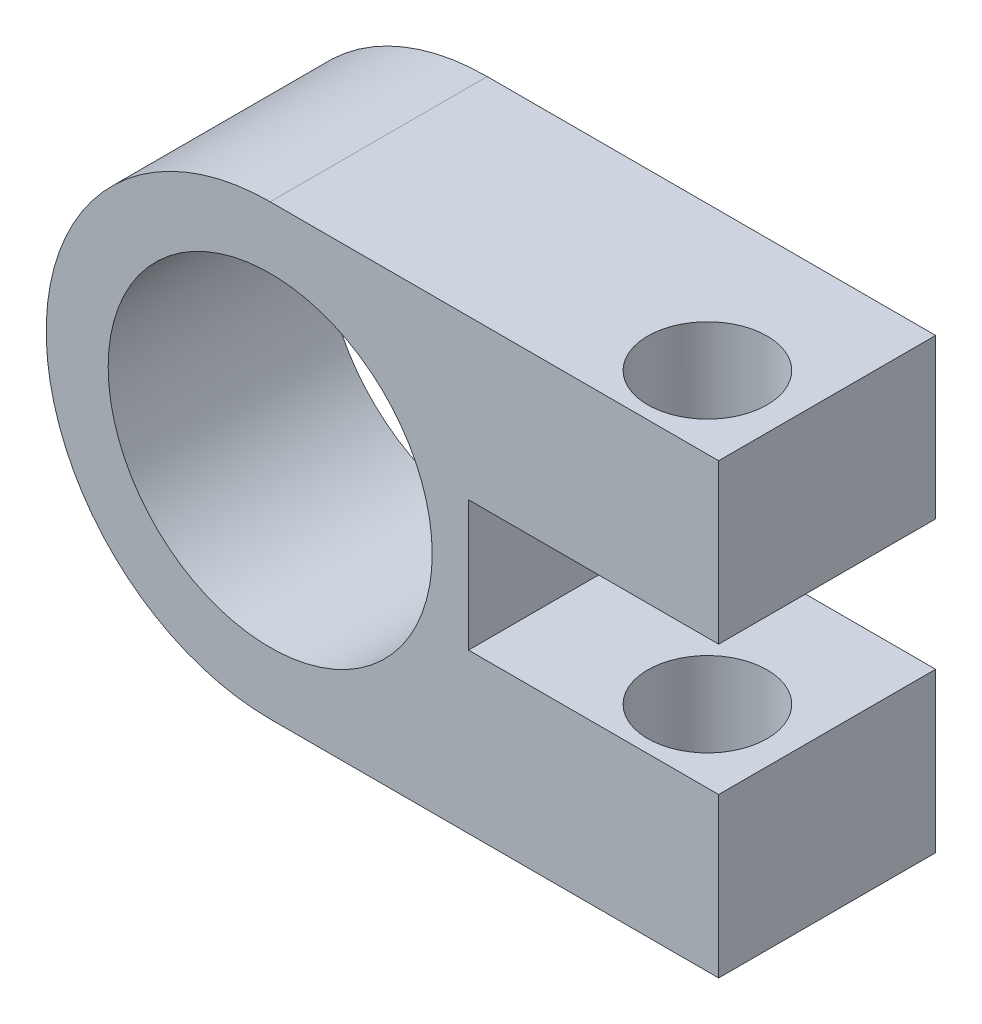
ISO-10303-21;
HEADER;
FILE_DESCRIPTION(('STEP AP214'),'2;1');
FILE_NAME('part.step','',(''),(''),'','','');
FILE_SCHEMA(('AUTOMOTIVE_DESIGN { 1 0 10303 214 1 1 1 1 }'));
ENDSEC;
DATA;
#1=APPLICATION_CONTEXT('core data for automotive mechanical design processes');
#2=APPLICATION_PROTOCOL_DEFINITION('international standard','automotive_design',2000,#1);
#3=PRODUCT_CONTEXT('',#1,'mechanical');
#4=PRODUCT('Part','Part','',(#3));
#5=PRODUCT_RELATED_PRODUCT_CATEGORY('part','',(#4));
#6=PRODUCT_DEFINITION_FORMATION('','',#4);
#7=PRODUCT_DEFINITION_CONTEXT('part definition',#1,'design');
#8=PRODUCT_DEFINITION('design','',#6,#7);
#9=PRODUCT_DEFINITION_SHAPE('','',#8);
#10=(LENGTH_UNIT() NAMED_UNIT(*) SI_UNIT(.MILLI.,.METRE.));
#11=(NAMED_UNIT(*) PLANE_ANGLE_UNIT() SI_UNIT($,.RADIAN.));
#12=(NAMED_UNIT(*) SI_UNIT($,.STERADIAN.) SOLID_ANGLE_UNIT());
#13=UNCERTAINTY_MEASURE_WITH_UNIT(LENGTH_MEASURE(1.E-05),#10,'distance_accuracy_value','');
#14=(GEOMETRIC_REPRESENTATION_CONTEXT(3) GLOBAL_UNCERTAINTY_ASSIGNED_CONTEXT((#13)) GLOBAL_UNIT_ASSIGNED_CONTEXT((#10,
#11,#12)) REPRESENTATION_CONTEXT('',''));
#15=CARTESIAN_POINT('',(0.,0.,0.));
#16=DIRECTION('',(0.,0.,1.));
#17=DIRECTION('',(1.,0.,0.));
#18=AXIS2_PLACEMENT_3D('',#15,#16,#17);
#19=CARTESIAN_POINT('',(31.,-15.4836362305049,15.));
#20=DIRECTION('',(-1.,0.,0.));
#21=DIRECTION('',(0.,0.,1.));
#22=AXIS2_PLACEMENT_3D('',#19,#20,#21);
#23=PLANE('',#22);
#24=DIRECTION('',(0.,0.,1.));
#25=VECTOR('',#24,1.);
#26=CARTESIAN_POINT('',(31.,4.5,-23.));
#27=LINE('',#26,#25);
#28=CARTESIAN_POINT('',(31.,4.5,0.));
#29=VERTEX_POINT('',#28);
#30=CARTESIAN_POINT('',(31.,4.5,15.));
#31=VERTEX_POINT('',#30);
#32=EDGE_CURVE('E186',#29,#31,#27,.T.);
#33=ORIENTED_EDGE('',*,*,#32,.F.);
#34=DIRECTION('',(0.,1.,0.));
#35=VECTOR('',#34,1.);
#36=CARTESIAN_POINT('',(31.,-15.4836362305049,0.));
#37=LINE('',#36,#35);
#38=CARTESIAN_POINT('',(31.,15.4836362305049,0.));
#39=VERTEX_POINT('',#38);
#40=EDGE_CURVE('E145',#29,#39,#37,.T.);
#41=ORIENTED_EDGE('',*,*,#40,.T.);
#42=DIRECTION('',(0.,0.,-1.));
#43=VECTOR('',#42,1.);
#44=CARTESIAN_POINT('',(31.,15.4836362305049,15.));
#45=LINE('',#44,#43);
#46=CARTESIAN_POINT('',(31.,15.4836362305049,15.));
#47=VERTEX_POINT('',#46);
#48=EDGE_CURVE('E150',#47,#39,#45,.T.);
#49=ORIENTED_EDGE('',*,*,#48,.F.);
#50=DIRECTION('',(0.,1.,0.));
#51=VECTOR('',#50,1.);
#52=CARTESIAN_POINT('',(31.,-15.4836362305049,15.));
#53=LINE('',#52,#51);
#54=EDGE_CURVE('E132',#31,#47,#53,.T.);
#55=ORIENTED_EDGE('',*,*,#54,.F.);
#56=EDGE_LOOP('',(#33,#41,#49,#55));
#57=FACE_BOUND('',#56,.T.);
#58=ADVANCED_FACE('F33',(#57),#23,.F.);
#59=CARTESIAN_POINT('',(25.207969836714,22.5163637694951,9.98293542380679));
#60=DIRECTION('',(0.,-1.,0.));
#61=DIRECTION('',(0.,0.,-1.));
#62=AXIS2_PLACEMENT_3D('',#59,#60,#61);
#63=CYLINDRICAL_SURFACE('',#62,4.125);
#64=CARTESIAN_POINT('',(25.207969836714,15.4836362305049,9.98293542380679));
#65=DIRECTION('',(0.,-1.,0.));
#66=DIRECTION('',(0.,0.,-1.));
#67=AXIS2_PLACEMENT_3D('',#64,#65,#66);
#68=CIRCLE('',#67,4.125);
#69=CARTESIAN_POINT('',(25.207969836714,15.4836362305049,5.8579354238068));
#70=VERTEX_POINT('',#69);
#71=EDGE_CURVE('E155',#70,#70,#68,.T.);
#72=ORIENTED_EDGE('',*,*,#71,.F.);
#73=EDGE_LOOP('',(#72));
#74=FACE_BOUND('',#73,.T.);
#75=CARTESIAN_POINT('',(25.207969836714,4.5,9.98293542380679));
#76=DIRECTION('',(0.,-1.,0.));
#77=DIRECTION('',(1.,0.,0.));
#78=AXIS2_PLACEMENT_3D('',#75,#76,#77);
#79=CIRCLE('',#78,4.125);
#80=CARTESIAN_POINT('',(29.332969836714,4.5,9.98293542380679));
#81=VERTEX_POINT('',#80);
#82=EDGE_CURVE('E128',#81,#81,#79,.F.);
#83=ORIENTED_EDGE('',*,*,#82,.F.);
#84=EDGE_LOOP('',(#83));
#85=FACE_BOUND('',#84,.T.);
#86=ADVANCED_FACE('F213',(#74,#85),#63,.F.);
#87=CARTESIAN_POINT('',(0.,0.,15.));
#88=DIRECTION('',(0.,0.,1.));
#89=DIRECTION('',(1.,0.,0.));
#90=AXIS2_PLACEMENT_3D('',#87,#88,#89);
#91=PLANE('',#90);
#92=DIRECTION('',(1.,0.,0.));
#93=VECTOR('',#92,1.);
#94=CARTESIAN_POINT('',(13.7081172853874,-4.5,15.));
#95=LINE('',#94,#93);
#96=CARTESIAN_POINT('',(13.7081172853874,-4.5,15.));
#97=VERTEX_POINT('',#96);
#98=CARTESIAN_POINT('',(31.,-4.5,15.));
#99=VERTEX_POINT('',#98);
#100=EDGE_CURVE('E108',#97,#99,#95,.T.);
#101=ORIENTED_EDGE('',*,*,#100,.F.);
#102=DIRECTION('',(0.,-1.,0.));
#103=VECTOR('',#102,1.);
#104=CARTESIAN_POINT('',(13.7081172853874,4.5,15.));
#105=LINE('',#104,#103);
#106=CARTESIAN_POINT('',(13.7081172853874,4.5,15.));
#107=VERTEX_POINT('',#106);
#108=EDGE_CURVE('E118',#107,#97,#105,.T.);
#109=ORIENTED_EDGE('',*,*,#108,.F.);
#110=DIRECTION('',(1.,0.,0.));
#111=VECTOR('',#110,1.);
#112=CARTESIAN_POINT('',(25.4581172853874,4.5,15.));
#113=LINE('',#112,#111);
#114=EDGE_CURVE('E190',#107,#31,#113,.T.);
#115=ORIENTED_EDGE('',*,*,#114,.T.);
#116=ORIENTED_EDGE('',*,*,#54,.T.);
#117=DIRECTION('',(-1.,0.,0.));
#118=VECTOR('',#117,1.);
#119=CARTESIAN_POINT('',(0.,15.4836362305049,15.));
#120=LINE('',#119,#118);
#121=CARTESIAN_POINT('',(0.,15.4836362305049,15.));
#122=VERTEX_POINT('',#121);
#123=EDGE_CURVE('E57',#47,#122,#120,.T.);
#124=ORIENTED_EDGE('',*,*,#123,.T.);
#125=CARTESIAN_POINT('',(0.,0.,15.));
#126=DIRECTION('',(0.,0.,1.));
#127=DIRECTION('',(1.,0.,0.));
#128=AXIS2_PLACEMENT_3D('',#125,#126,#127);
#129=CIRCLE('',#128,15.4836362305049);
#130=CARTESIAN_POINT('',(0.,-15.4836362305049,15.));
#131=VERTEX_POINT('',#130);
#132=EDGE_CURVE('E148',#122,#131,#129,.T.);
#133=ORIENTED_EDGE('',*,*,#132,.T.);
#134=DIRECTION('',(1.,0.,0.));
#135=VECTOR('',#134,1.);
#136=CARTESIAN_POINT('',(0.,-15.4836362305049,15.));
#137=LINE('',#136,#135);
#138=CARTESIAN_POINT('',(31.,-15.4836362305049,15.));
#139=VERTEX_POINT('',#138);
#140=EDGE_CURVE('E86',#131,#139,#137,.T.);
#141=ORIENTED_EDGE('',*,*,#140,.T.);
#142=EDGE_CURVE('E125',#139,#99,#53,.T.);
#143=ORIENTED_EDGE('',*,*,#142,.T.);
#144=EDGE_LOOP('',(#101,#109,#115,#116,#124,#133,#141,#143));
#145=FACE_BOUND('',#144,.T.);
#146=CARTESIAN_POINT('',(0.,0.,15.));
#147=DIRECTION('',(0.,0.,1.));
#148=DIRECTION('',(1.,0.,0.));
#149=AXIS2_PLACEMENT_3D('',#146,#147,#148);
#150=CIRCLE('',#149,11.2);
#151=CARTESIAN_POINT('',(11.2,0.,15.));
#152=VERTEX_POINT('',#151);
#153=EDGE_CURVE('E143',#152,#152,#150,.T.);
#154=ORIENTED_EDGE('',*,*,#153,.F.);
#155=EDGE_LOOP('',(#154));
#156=FACE_BOUND('',#155,.T.);
#157=ADVANCED_FACE('F130',(#145,#156),#91,.T.);
#158=CARTESIAN_POINT('',(0.,0.,0.));
#159=DIRECTION('',(0.,0.,1.));
#160=DIRECTION('',(1.,0.,0.));
#161=AXIS2_PLACEMENT_3D('',#158,#159,#160);
#162=PLANE('',#161);
#163=DIRECTION('',(0.,-1.,0.));
#164=VECTOR('',#163,1.);
#165=CARTESIAN_POINT('',(13.7081172853874,0.,0.));
#166=LINE('',#165,#164);
#167=CARTESIAN_POINT('',(13.7081172853874,4.5,0.));
#168=VERTEX_POINT('',#167);
#169=CARTESIAN_POINT('',(13.7081172853874,-4.5,0.));
#170=VERTEX_POINT('',#169);
#171=EDGE_CURVE('E11',#168,#170,#166,.T.);
#172=ORIENTED_EDGE('',*,*,#171,.T.);
#173=DIRECTION('',(1.,0.,0.));
#174=VECTOR('',#173,1.);
#175=CARTESIAN_POINT('',(0.,-4.5,0.));
#176=LINE('',#175,#174);
#177=CARTESIAN_POINT('',(31.,-4.5,0.));
#178=VERTEX_POINT('',#177);
#179=EDGE_CURVE('E163',#170,#178,#176,.T.);
#180=ORIENTED_EDGE('',*,*,#179,.T.);
#181=CARTESIAN_POINT('',(31.,-15.4836362305049,0.));
#182=VERTEX_POINT('',#181);
#183=EDGE_CURVE('E127',#182,#178,#37,.T.);
#184=ORIENTED_EDGE('',*,*,#183,.F.);
#185=DIRECTION('',(1.,0.,0.));
#186=VECTOR('',#185,1.);
#187=CARTESIAN_POINT('',(0.,-15.4836362305049,0.));
#188=LINE('',#187,#186);
#189=CARTESIAN_POINT('',(0.,-15.4836362305049,0.));
#190=VERTEX_POINT('',#189);
#191=EDGE_CURVE('E142',#190,#182,#188,.T.);
#192=ORIENTED_EDGE('',*,*,#191,.F.);
#193=CARTESIAN_POINT('',(0.,0.,0.));
#194=DIRECTION('',(0.,0.,1.));
#195=DIRECTION('',(1.,0.,0.));
#196=AXIS2_PLACEMENT_3D('',#193,#194,#195);
#197=CIRCLE('',#196,15.4836362305049);
#198=CARTESIAN_POINT('',(0.,15.4836362305049,0.));
#199=VERTEX_POINT('',#198);
#200=EDGE_CURVE('E139',#199,#190,#197,.T.);
#201=ORIENTED_EDGE('',*,*,#200,.F.);
#202=DIRECTION('',(-1.,0.,0.));
#203=VECTOR('',#202,1.);
#204=CARTESIAN_POINT('',(0.,15.4836362305049,0.));
#205=LINE('',#204,#203);
#206=EDGE_CURVE('E78',#39,#199,#205,.T.);
#207=ORIENTED_EDGE('',*,*,#206,.F.);
#208=ORIENTED_EDGE('',*,*,#40,.F.);
#209=DIRECTION('',(1.,0.,0.));
#210=VECTOR('',#209,1.);
#211=CARTESIAN_POINT('',(0.,4.5,0.));
#212=LINE('',#211,#210);
#213=EDGE_CURVE('E48',#168,#29,#212,.T.);
#214=ORIENTED_EDGE('',*,*,#213,.F.);
#215=EDGE_LOOP('',(#172,#180,#184,#192,#201,#207,#208,#214));
#216=FACE_BOUND('',#215,.T.);
#217=CARTESIAN_POINT('',(0.,0.,0.));
#218=DIRECTION('',(0.,0.,1.));
#219=DIRECTION('',(1.,0.,0.));
#220=AXIS2_PLACEMENT_3D('',#217,#218,#219);
#221=CIRCLE('',#220,11.2);
#222=CARTESIAN_POINT('',(11.2,0.,0.));
#223=VERTEX_POINT('',#222);
#224=EDGE_CURVE('E158',#223,#223,#221,.T.);
#225=ORIENTED_EDGE('',*,*,#224,.T.);
#226=EDGE_LOOP('',(#225));
#227=FACE_BOUND('',#226,.T.);
#228=ADVANCED_FACE('F181',(#216,#227),#162,.F.);
#229=CARTESIAN_POINT('',(0.,0.,15.));
#230=DIRECTION('',(0.,0.,-1.));
#231=DIRECTION('',(-1.,0.,0.));
#232=AXIS2_PLACEMENT_3D('',#229,#230,#231);
#233=CYLINDRICAL_SURFACE('',#232,15.4836362305049);
#234=ORIENTED_EDGE('',*,*,#200,.T.);
#235=DIRECTION('',(0.,0.,-1.));
#236=VECTOR('',#235,1.);
#237=CARTESIAN_POINT('',(0.,-15.4836362305049,15.));
#238=LINE('',#237,#236);
#239=EDGE_CURVE('E41',#131,#190,#238,.T.);
#240=ORIENTED_EDGE('',*,*,#239,.F.);
#241=ORIENTED_EDGE('',*,*,#132,.F.);
#242=DIRECTION('',(0.,0.,-1.));
#243=VECTOR('',#242,1.);
#244=CARTESIAN_POINT('',(0.,15.4836362305049,15.));
#245=LINE('',#244,#243);
#246=EDGE_CURVE('E134',#122,#199,#245,.T.);
#247=ORIENTED_EDGE('',*,*,#246,.T.);
#248=EDGE_LOOP('',(#234,#240,#241,#247));
#249=FACE_BOUND('',#248,.T.);
#250=ADVANCED_FACE('F35',(#249),#233,.T.);
#251=CARTESIAN_POINT('',(0.,-15.4836362305049,15.));
#252=DIRECTION('',(0.,1.,0.));
#253=DIRECTION('',(0.,0.,1.));
#254=AXIS2_PLACEMENT_3D('',#251,#252,#253);
#255=PLANE('',#254);
#256=CARTESIAN_POINT('',(25.207969836714,-15.4836362305049,9.98293542380679));
#257=DIRECTION('',(0.,-1.,0.));
#258=DIRECTION('',(0.,0.,-1.));
#259=AXIS2_PLACEMENT_3D('',#256,#257,#258);
#260=CIRCLE('',#259,4.125);
#261=CARTESIAN_POINT('',(25.207969836714,-15.4836362305049,5.8579354238068));
#262=VERTEX_POINT('',#261);
#263=EDGE_CURVE('E159',#262,#262,#260,.T.);
#264=ORIENTED_EDGE('',*,*,#263,.F.);
#265=EDGE_LOOP('',(#264));
#266=FACE_BOUND('',#265,.T.);
#267=ORIENTED_EDGE('',*,*,#191,.T.);
#268=DIRECTION('',(0.,0.,-1.));
#269=VECTOR('',#268,1.);
#270=CARTESIAN_POINT('',(31.,-15.4836362305049,15.));
#271=LINE('',#270,#269);
#272=EDGE_CURVE('E152',#139,#182,#271,.T.);
#273=ORIENTED_EDGE('',*,*,#272,.F.);
#274=ORIENTED_EDGE('',*,*,#140,.F.);
#275=ORIENTED_EDGE('',*,*,#239,.T.);
#276=EDGE_LOOP('',(#267,#273,#274,#275));
#277=FACE_BOUND('',#276,.T.);
#278=ADVANCED_FACE('F179',(#266,#277),#255,.F.);
#279=ORIENTED_EDGE('',*,*,#183,.T.);
#280=DIRECTION('',(0.,0.,1.));
#281=VECTOR('',#280,1.);
#282=CARTESIAN_POINT('',(31.,-4.5,-23.));
#283=LINE('',#282,#281);
#284=EDGE_CURVE('E111',#178,#99,#283,.T.);
#285=ORIENTED_EDGE('',*,*,#284,.T.);
#286=ORIENTED_EDGE('',*,*,#142,.F.);
#287=ORIENTED_EDGE('',*,*,#272,.T.);
#288=EDGE_LOOP('',(#279,#285,#286,#287));
#289=FACE_BOUND('',#288,.T.);
#290=ADVANCED_FACE('F123',(#289),#23,.F.);
#291=CARTESIAN_POINT('',(0.,15.4836362305049,15.));
#292=DIRECTION('',(0.,-1.,0.));
#293=DIRECTION('',(0.,0.,-1.));
#294=AXIS2_PLACEMENT_3D('',#291,#292,#293);
#295=PLANE('',#294);
#296=ORIENTED_EDGE('',*,*,#71,.T.);
#297=EDGE_LOOP('',(#296));
#298=FACE_BOUND('',#297,.T.);
#299=ORIENTED_EDGE('',*,*,#206,.T.);
#300=ORIENTED_EDGE('',*,*,#246,.F.);
#301=ORIENTED_EDGE('',*,*,#123,.F.);
#302=ORIENTED_EDGE('',*,*,#48,.T.);
#303=EDGE_LOOP('',(#299,#300,#301,#302));
#304=FACE_BOUND('',#303,.T.);
#305=ADVANCED_FACE('F198',(#298,#304),#295,.F.);
#306=CARTESIAN_POINT('',(0.,0.,15.));
#307=DIRECTION('',(0.,0.,-1.));
#308=DIRECTION('',(-1.,0.,0.));
#309=AXIS2_PLACEMENT_3D('',#306,#307,#308);
#310=CYLINDRICAL_SURFACE('',#309,11.2);
#311=ORIENTED_EDGE('',*,*,#153,.T.);
#312=EDGE_LOOP('',(#311));
#313=FACE_BOUND('',#312,.T.);
#314=ORIENTED_EDGE('',*,*,#224,.F.);
#315=EDGE_LOOP('',(#314));
#316=FACE_BOUND('',#315,.T.);
#317=ADVANCED_FACE('F200',(#313,#316),#310,.F.);
#318=CARTESIAN_POINT('',(25.207969836714,-4.5,9.98293542380679));
#319=DIRECTION('',(0.,-1.,0.));
#320=DIRECTION('',(1.,0.,0.));
#321=AXIS2_PLACEMENT_3D('',#318,#319,#320);
#322=CIRCLE('',#321,4.125);
#323=CARTESIAN_POINT('',(29.332969836714,-4.5,9.98293542380679));
#324=VERTEX_POINT('',#323);
#325=EDGE_CURVE('E161',#324,#324,#322,.F.);
#326=ORIENTED_EDGE('',*,*,#325,.T.);
#327=EDGE_LOOP('',(#326));
#328=FACE_BOUND('',#327,.T.);
#329=ORIENTED_EDGE('',*,*,#263,.T.);
#330=EDGE_LOOP('',(#329));
#331=FACE_BOUND('',#330,.T.);
#332=ADVANCED_FACE('F207',(#328,#331),#63,.F.);
#333=CARTESIAN_POINT('',(13.7081172853874,4.5,-23.));
#334=DIRECTION('',(-1.,0.,0.));
#335=DIRECTION('',(0.,0.,1.));
#336=AXIS2_PLACEMENT_3D('',#333,#334,#335);
#337=PLANE('',#336);
#338=DIRECTION('',(0.,0.,1.));
#339=VECTOR('',#338,1.);
#340=CARTESIAN_POINT('',(13.7081172853874,4.5,-23.));
#341=LINE('',#340,#339);
#342=EDGE_CURVE('E185',#168,#107,#341,.T.);
#343=ORIENTED_EDGE('',*,*,#342,.T.);
#344=ORIENTED_EDGE('',*,*,#108,.T.);
#345=DIRECTION('',(0.,0.,1.));
#346=VECTOR('',#345,1.);
#347=CARTESIAN_POINT('',(13.7081172853874,-4.5,-23.));
#348=LINE('',#347,#346);
#349=EDGE_CURVE('E114',#170,#97,#348,.T.);
#350=ORIENTED_EDGE('',*,*,#349,.F.);
#351=ORIENTED_EDGE('',*,*,#171,.F.);
#352=EDGE_LOOP('',(#343,#344,#350,#351));
#353=FACE_BOUND('',#352,.T.);
#354=ADVANCED_FACE('F184',(#353),#337,.F.);
#355=CARTESIAN_POINT('',(13.7081172853874,-4.5,-23.));
#356=DIRECTION('',(0.,-1.,0.));
#357=DIRECTION('',(1.,0.,0.));
#358=AXIS2_PLACEMENT_3D('',#355,#356,#357);
#359=PLANE('',#358);
#360=ORIENTED_EDGE('',*,*,#325,.F.);
#361=EDGE_LOOP('',(#360));
#362=FACE_BOUND('',#361,.T.);
#363=ORIENTED_EDGE('',*,*,#349,.T.);
#364=ORIENTED_EDGE('',*,*,#100,.T.);
#365=ORIENTED_EDGE('',*,*,#284,.F.);
#366=ORIENTED_EDGE('',*,*,#179,.F.);
#367=EDGE_LOOP('',(#363,#364,#365,#366));
#368=FACE_BOUND('',#367,.T.);
#369=ADVANCED_FACE('F110',(#362,#368),#359,.F.);
#370=CARTESIAN_POINT('',(25.4581172853874,4.5,-23.));
#371=DIRECTION('',(0.,-1.,0.));
#372=DIRECTION('',(1.,0.,0.));
#373=AXIS2_PLACEMENT_3D('',#370,#371,#372);
#374=PLANE('',#373);
#375=ORIENTED_EDGE('',*,*,#82,.T.);
#376=EDGE_LOOP('',(#375));
#377=FACE_BOUND('',#376,.T.);
#378=ORIENTED_EDGE('',*,*,#213,.T.);
#379=ORIENTED_EDGE('',*,*,#32,.T.);
#380=ORIENTED_EDGE('',*,*,#114,.F.);
#381=ORIENTED_EDGE('',*,*,#342,.F.);
#382=EDGE_LOOP('',(#378,#379,#380,#381));
#383=FACE_BOUND('',#382,.T.);
#384=ADVANCED_FACE('F295',(#377,#383),#374,.T.);
#385=CLOSED_SHELL('',(#58,#86,#157,#228,#250,#278,#290,#305,#317,#332,#354,#369,#384));
#386=MANIFOLD_SOLID_BREP('B2',#385);
#387=ADVANCED_BREP_SHAPE_REPRESENTATION('',(#18,#386),#14);
#388=SHAPE_DEFINITION_REPRESENTATION(#9,#387);
ENDSEC;
END-ISO-10303-21;
